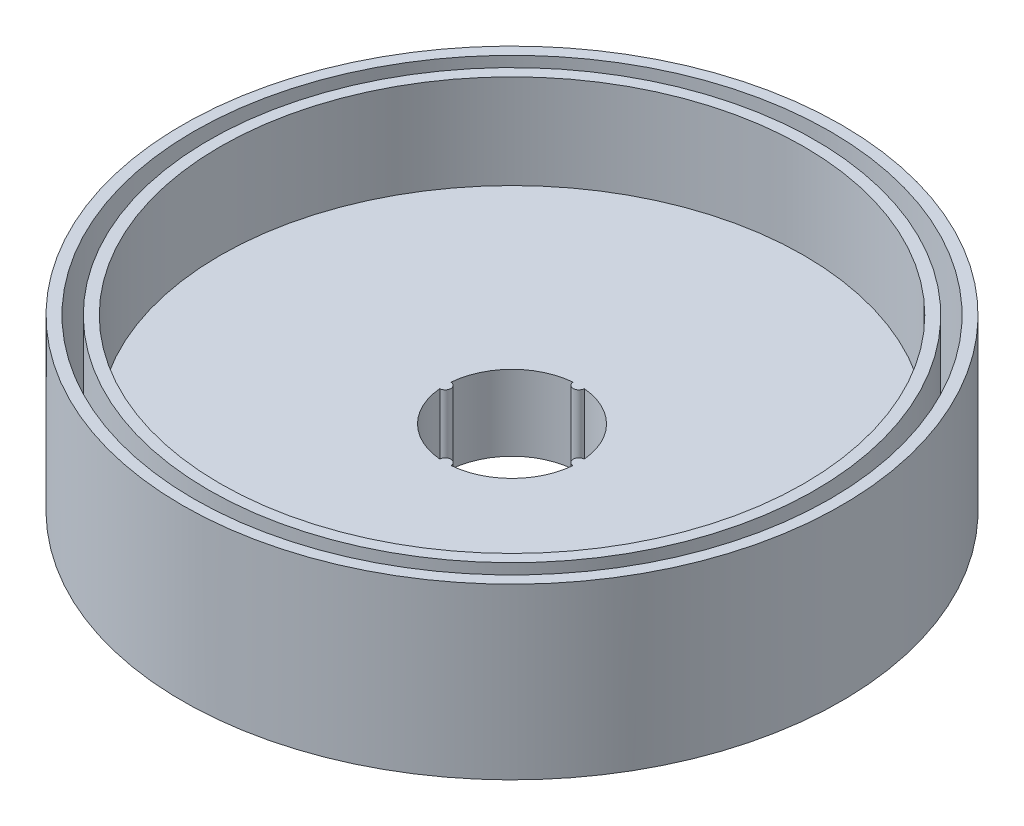
ISO-10303-21;
HEADER;
FILE_DESCRIPTION(('STEP AP214'),'2;1');
FILE_NAME('part.step','',(''),(''),'','','');
FILE_SCHEMA(('AUTOMOTIVE_DESIGN { 1 0 10303 214 1 1 1 1 }'));
ENDSEC;
DATA;
#1=APPLICATION_CONTEXT('core data for automotive mechanical design processes');
#2=APPLICATION_PROTOCOL_DEFINITION('international standard','automotive_design',2000,#1);
#3=PRODUCT_CONTEXT('',#1,'mechanical');
#4=PRODUCT('Part','Part','',(#3));
#5=PRODUCT_RELATED_PRODUCT_CATEGORY('part','',(#4));
#6=PRODUCT_DEFINITION_FORMATION('','',#4);
#7=PRODUCT_DEFINITION_CONTEXT('part definition',#1,'design');
#8=PRODUCT_DEFINITION('design','',#6,#7);
#9=PRODUCT_DEFINITION_SHAPE('','',#8);
#10=(LENGTH_UNIT() NAMED_UNIT(*) SI_UNIT(.MILLI.,.METRE.));
#11=(NAMED_UNIT(*) PLANE_ANGLE_UNIT() SI_UNIT($,.RADIAN.));
#12=(NAMED_UNIT(*) SI_UNIT($,.STERADIAN.) SOLID_ANGLE_UNIT());
#13=UNCERTAINTY_MEASURE_WITH_UNIT(LENGTH_MEASURE(1.E-05),#10,'distance_accuracy_value','');
#14=(GEOMETRIC_REPRESENTATION_CONTEXT(3) GLOBAL_UNCERTAINTY_ASSIGNED_CONTEXT((#13)) GLOBAL_UNIT_ASSIGNED_CONTEXT((#10,
#11,#12)) REPRESENTATION_CONTEXT('',''));
#15=CARTESIAN_POINT('',(0.,0.,0.));
#16=DIRECTION('',(0.,0.,1.));
#17=DIRECTION('',(1.,0.,0.));
#18=AXIS2_PLACEMENT_3D('',#15,#16,#17);
#19=CARTESIAN_POINT('',(0.,5.,0.));
#20=DIRECTION('',(0.,1.,0.));
#21=DIRECTION('',(0.,0.,1.));
#22=AXIS2_PLACEMENT_3D('',#19,#20,#21);
#23=PLANE('',#22);
#24=CARTESIAN_POINT('',(0.,5.,0.));
#25=DIRECTION('',(0.,1.,0.));
#26=DIRECTION('',(0.,0.,1.));
#27=AXIS2_PLACEMENT_3D('',#24,#25,#26);
#28=CIRCLE('',#27,15.5);
#29=CARTESIAN_POINT('',(0.,5.,15.5));
#30=VERTEX_POINT('',#29);
#31=EDGE_CURVE('E41',#30,#30,#28,.T.);
#32=ORIENTED_EDGE('',*,*,#31,.F.);
#33=EDGE_LOOP('',(#32));
#34=FACE_BOUND('',#33,.T.);
#35=CARTESIAN_POINT('',(0.,5.,0.));
#36=DIRECTION('',(0.,1.,0.));
#37=DIRECTION('',(0.,0.,1.));
#38=AXIS2_PLACEMENT_3D('',#35,#36,#37);
#39=CIRCLE('',#38,16.1);
#40=CARTESIAN_POINT('',(0.,5.,16.1));
#41=VERTEX_POINT('',#40);
#42=EDGE_CURVE('E197',#41,#41,#39,.T.);
#43=ORIENTED_EDGE('',*,*,#42,.T.);
#44=EDGE_LOOP('',(#43));
#45=FACE_BOUND('',#44,.T.);
#46=ADVANCED_FACE('F33',(#34,#45),#23,.T.);
#47=CARTESIAN_POINT('',(0.,5.,0.));
#48=DIRECTION('',(0.,1.,0.));
#49=DIRECTION('',(0.,0.,1.));
#50=AXIS2_PLACEMENT_3D('',#47,#48,#49);
#51=CIRCLE('',#50,16.9);
#52=CARTESIAN_POINT('',(0.,5.,16.9));
#53=VERTEX_POINT('',#52);
#54=EDGE_CURVE('E202',#53,#53,#51,.T.);
#55=ORIENTED_EDGE('',*,*,#54,.F.);
#56=EDGE_LOOP('',(#55));
#57=FACE_BOUND('',#56,.T.);
#58=CARTESIAN_POINT('',(0.,5.,0.));
#59=DIRECTION('',(0.,1.,0.));
#60=DIRECTION('',(0.,0.,1.));
#61=AXIS2_PLACEMENT_3D('',#58,#59,#60);
#62=CIRCLE('',#61,17.5);
#63=CARTESIAN_POINT('',(0.,5.,17.5));
#64=VERTEX_POINT('',#63);
#65=EDGE_CURVE('E11',#64,#64,#62,.T.);
#66=ORIENTED_EDGE('',*,*,#65,.T.);
#67=EDGE_LOOP('',(#66));
#68=FACE_BOUND('',#67,.T.);
#69=ADVANCED_FACE('F185',(#57,#68),#23,.T.);
#70=CARTESIAN_POINT('',(0.,5.,0.));
#71=DIRECTION('',(0.,-1.,0.));
#72=DIRECTION('',(0.,0.,-1.));
#73=AXIS2_PLACEMENT_3D('',#70,#71,#72);
#74=CYLINDRICAL_SURFACE('',#73,17.5);
#75=ORIENTED_EDGE('',*,*,#65,.F.);
#76=EDGE_LOOP('',(#75));
#77=FACE_BOUND('',#76,.T.);
#78=CARTESIAN_POINT('',(0.,-4.,0.));
#79=DIRECTION('',(0.,-1.,0.));
#80=DIRECTION('',(0.,0.,-1.));
#81=AXIS2_PLACEMENT_3D('',#78,#79,#80);
#82=CIRCLE('',#81,17.5);
#83=CARTESIAN_POINT('',(0.,-4.,-17.5));
#84=VERTEX_POINT('',#83);
#85=EDGE_CURVE('E114',#84,#84,#82,.T.);
#86=ORIENTED_EDGE('',*,*,#85,.F.);
#87=EDGE_LOOP('',(#86));
#88=FACE_BOUND('',#87,.T.);
#89=ADVANCED_FACE('F35',(#77,#88),#74,.T.);
#90=CARTESIAN_POINT('',(0.,5.,0.));
#91=DIRECTION('',(0.,-1.,0.));
#92=DIRECTION('',(0.,0.,-1.));
#93=AXIS2_PLACEMENT_3D('',#90,#91,#92);
#94=CYLINDRICAL_SURFACE('',#93,15.5);
#95=ORIENTED_EDGE('',*,*,#31,.T.);
#96=EDGE_LOOP('',(#95));
#97=FACE_BOUND('',#96,.T.);
#98=CARTESIAN_POINT('',(0.,0.,0.));
#99=DIRECTION('',(0.,1.,0.));
#100=DIRECTION('',(0.,0.,1.));
#101=AXIS2_PLACEMENT_3D('',#98,#99,#100);
#102=CIRCLE('',#101,15.5);
#103=CARTESIAN_POINT('',(0.,0.,15.5));
#104=VERTEX_POINT('',#103);
#105=EDGE_CURVE('E168',#104,#104,#102,.T.);
#106=ORIENTED_EDGE('',*,*,#105,.F.);
#107=EDGE_LOOP('',(#106));
#108=FACE_BOUND('',#107,.T.);
#109=ADVANCED_FACE('F175',(#97,#108),#94,.F.);
#110=CARTESIAN_POINT('',(0.,0.,0.));
#111=DIRECTION('',(0.,-1.,0.));
#112=DIRECTION('',(0.,0.,-1.));
#113=AXIS2_PLACEMENT_3D('',#110,#111,#112);
#114=PLANE('',#113);
#115=CARTESIAN_POINT('',(0.,0.,0.));
#116=DIRECTION('',(0.,-1.,0.));
#117=DIRECTION('',(0.,0.,-1.));
#118=AXIS2_PLACEMENT_3D('',#115,#116,#117);
#119=CIRCLE('',#118,3.55);
#120=CARTESIAN_POINT('',(0.299732076354392,0.,-3.53732394366197));
#121=VERTEX_POINT('',#120);
#122=CARTESIAN_POINT('',(3.53732394366197,0.,-0.299732076354392));
#123=VERTEX_POINT('',#122);
#124=EDGE_CURVE('E56',#121,#123,#119,.T.);
#125=ORIENTED_EDGE('',*,*,#124,.T.);
#126=CARTESIAN_POINT('',(3.55,0.,0.));
#127=DIRECTION('',(0.,1.,0.));
#128=DIRECTION('',(0.,0.,-1.));
#129=AXIS2_PLACEMENT_3D('',#126,#127,#128);
#130=CIRCLE('',#129,0.3);
#131=CARTESIAN_POINT('',(3.53732394366197,0.,0.299732076354392));
#132=VERTEX_POINT('',#131);
#133=EDGE_CURVE('E113',#123,#132,#130,.T.);
#134=ORIENTED_EDGE('',*,*,#133,.T.);
#135=CARTESIAN_POINT('',(0.,0.,0.));
#136=DIRECTION('',(0.,-1.,0.));
#137=DIRECTION('',(0.,0.,-1.));
#138=AXIS2_PLACEMENT_3D('',#135,#136,#137);
#139=CIRCLE('',#138,3.55);
#140=CARTESIAN_POINT('',(0.299732076354392,0.,3.53732394366197));
#141=VERTEX_POINT('',#140);
#142=EDGE_CURVE('E138',#132,#141,#139,.T.);
#143=ORIENTED_EDGE('',*,*,#142,.T.);
#144=CARTESIAN_POINT('',(0.,0.,3.55));
#145=DIRECTION('',(0.,1.,0.));
#146=DIRECTION('',(0.,0.,-1.));
#147=AXIS2_PLACEMENT_3D('',#144,#145,#146);
#148=CIRCLE('',#147,0.3);
#149=CARTESIAN_POINT('',(-0.299732076354392,0.,3.53732394366197));
#150=VERTEX_POINT('',#149);
#151=EDGE_CURVE('E141',#141,#150,#148,.T.);
#152=ORIENTED_EDGE('',*,*,#151,.T.);
#153=CARTESIAN_POINT('',(0.,0.,0.));
#154=DIRECTION('',(0.,-1.,0.));
#155=DIRECTION('',(0.,0.,-1.));
#156=AXIS2_PLACEMENT_3D('',#153,#154,#155);
#157=CIRCLE('',#156,3.55);
#158=CARTESIAN_POINT('',(-3.53732394366197,0.,0.299732076354392));
#159=VERTEX_POINT('',#158);
#160=EDGE_CURVE('E144',#150,#159,#157,.T.);
#161=ORIENTED_EDGE('',*,*,#160,.T.);
#162=CARTESIAN_POINT('',(-3.55,0.,0.));
#163=DIRECTION('',(0.,1.,0.));
#164=DIRECTION('',(0.,0.,-1.));
#165=AXIS2_PLACEMENT_3D('',#162,#163,#164);
#166=CIRCLE('',#165,0.3);
#167=CARTESIAN_POINT('',(-3.53732394366197,0.,-0.299732076354392));
#168=VERTEX_POINT('',#167);
#169=EDGE_CURVE('E147',#159,#168,#166,.T.);
#170=ORIENTED_EDGE('',*,*,#169,.T.);
#171=CARTESIAN_POINT('',(0.,0.,0.));
#172=DIRECTION('',(0.,-1.,0.));
#173=DIRECTION('',(0.,0.,-1.));
#174=AXIS2_PLACEMENT_3D('',#171,#172,#173);
#175=CIRCLE('',#174,3.55);
#176=CARTESIAN_POINT('',(-0.299732076354392,0.,-3.53732394366197));
#177=VERTEX_POINT('',#176);
#178=EDGE_CURVE('E150',#168,#177,#175,.T.);
#179=ORIENTED_EDGE('',*,*,#178,.T.);
#180=CARTESIAN_POINT('',(0.,0.,-3.55));
#181=DIRECTION('',(0.,1.,0.));
#182=DIRECTION('',(0.,0.,-1.));
#183=AXIS2_PLACEMENT_3D('',#180,#181,#182);
#184=CIRCLE('',#183,0.3);
#185=EDGE_CURVE('E107',#177,#121,#184,.T.);
#186=ORIENTED_EDGE('',*,*,#185,.T.);
#187=EDGE_LOOP('',(#125,#134,#143,#152,#161,#170,#179,#186));
#188=FACE_BOUND('',#187,.T.);
#189=ORIENTED_EDGE('',*,*,#105,.T.);
#190=EDGE_LOOP('',(#189));
#191=FACE_BOUND('',#190,.T.);
#192=ADVANCED_FACE('F173',(#188,#191),#114,.F.);
#193=CARTESIAN_POINT('',(0.,-4.,0.));
#194=DIRECTION('',(0.,-1.,0.));
#195=DIRECTION('',(0.,0.,-1.));
#196=AXIS2_PLACEMENT_3D('',#193,#194,#195);
#197=PLANE('',#196);
#198=ORIENTED_EDGE('',*,*,#85,.T.);
#199=EDGE_LOOP('',(#198));
#200=FACE_BOUND('',#199,.T.);
#201=CARTESIAN_POINT('',(3.55,-4.,0.));
#202=DIRECTION('',(0.,1.,0.));
#203=DIRECTION('',(0.,0.,-1.));
#204=AXIS2_PLACEMENT_3D('',#201,#202,#203);
#205=CIRCLE('',#204,0.3);
#206=CARTESIAN_POINT('',(3.53732394366197,-4.,-0.299732076354392));
#207=VERTEX_POINT('',#206);
#208=CARTESIAN_POINT('',(3.53732394366197,-4.,0.299732076354392));
#209=VERTEX_POINT('',#208);
#210=EDGE_CURVE('E106',#207,#209,#205,.T.);
#211=ORIENTED_EDGE('',*,*,#210,.F.);
#212=CARTESIAN_POINT('',(0.,-4.,0.));
#213=DIRECTION('',(0.,-1.,0.));
#214=DIRECTION('',(0.,0.,-1.));
#215=AXIS2_PLACEMENT_3D('',#212,#213,#214);
#216=CIRCLE('',#215,3.55);
#217=CARTESIAN_POINT('',(0.299732076354392,-4.,-3.53732394366197));
#218=VERTEX_POINT('',#217);
#219=EDGE_CURVE('E98',#218,#207,#216,.T.);
#220=ORIENTED_EDGE('',*,*,#219,.F.);
#221=CARTESIAN_POINT('',(0.,-4.,-3.55));
#222=DIRECTION('',(0.,1.,0.));
#223=DIRECTION('',(0.,0.,-1.));
#224=AXIS2_PLACEMENT_3D('',#221,#222,#223);
#225=CIRCLE('',#224,0.3);
#226=CARTESIAN_POINT('',(-0.299732076354392,-4.,-3.53732394366197));
#227=VERTEX_POINT('',#226);
#228=EDGE_CURVE('E133',#227,#218,#225,.T.);
#229=ORIENTED_EDGE('',*,*,#228,.F.);
#230=CARTESIAN_POINT('',(0.,-4.,0.));
#231=DIRECTION('',(0.,-1.,0.));
#232=DIRECTION('',(0.,0.,-1.));
#233=AXIS2_PLACEMENT_3D('',#230,#231,#232);
#234=CIRCLE('',#233,3.55);
#235=CARTESIAN_POINT('',(-3.53732394366197,-4.,-0.299732076354392));
#236=VERTEX_POINT('',#235);
#237=EDGE_CURVE('E131',#236,#227,#234,.T.);
#238=ORIENTED_EDGE('',*,*,#237,.F.);
#239=CARTESIAN_POINT('',(-3.55,-4.,0.));
#240=DIRECTION('',(0.,1.,0.));
#241=DIRECTION('',(0.,0.,-1.));
#242=AXIS2_PLACEMENT_3D('',#239,#240,#241);
#243=CIRCLE('',#242,0.3);
#244=CARTESIAN_POINT('',(-3.53732394366197,-4.,0.299732076354392));
#245=VERTEX_POINT('',#244);
#246=EDGE_CURVE('E129',#245,#236,#243,.T.);
#247=ORIENTED_EDGE('',*,*,#246,.F.);
#248=CARTESIAN_POINT('',(0.,-4.,0.));
#249=DIRECTION('',(0.,-1.,0.));
#250=DIRECTION('',(0.,0.,-1.));
#251=AXIS2_PLACEMENT_3D('',#248,#249,#250);
#252=CIRCLE('',#251,3.55);
#253=CARTESIAN_POINT('',(-0.299732076354392,-4.,3.53732394366197));
#254=VERTEX_POINT('',#253);
#255=EDGE_CURVE('E127',#254,#245,#252,.T.);
#256=ORIENTED_EDGE('',*,*,#255,.F.);
#257=CARTESIAN_POINT('',(0.,-4.,3.55));
#258=DIRECTION('',(0.,1.,0.));
#259=DIRECTION('',(0.,0.,-1.));
#260=AXIS2_PLACEMENT_3D('',#257,#258,#259);
#261=CIRCLE('',#260,0.3);
#262=CARTESIAN_POINT('',(0.299732076354392,-4.,3.53732394366197));
#263=VERTEX_POINT('',#262);
#264=EDGE_CURVE('E122',#263,#254,#261,.T.);
#265=ORIENTED_EDGE('',*,*,#264,.F.);
#266=CARTESIAN_POINT('',(0.,-4.,0.));
#267=DIRECTION('',(0.,-1.,0.));
#268=DIRECTION('',(0.,0.,-1.));
#269=AXIS2_PLACEMENT_3D('',#266,#267,#268);
#270=CIRCLE('',#269,3.55);
#271=EDGE_CURVE('E120',#209,#263,#270,.T.);
#272=ORIENTED_EDGE('',*,*,#271,.F.);
#273=EDGE_LOOP('',(#211,#220,#229,#238,#247,#256,#265,#272));
#274=FACE_BOUND('',#273,.T.);
#275=ADVANCED_FACE('F118',(#200,#274),#197,.T.);
#276=CARTESIAN_POINT('',(0.,-4.,0.));
#277=DIRECTION('',(0.,1.,0.));
#278=DIRECTION('',(0.,0.,1.));
#279=AXIS2_PLACEMENT_3D('',#276,#277,#278);
#280=CYLINDRICAL_SURFACE('',#279,3.55);
#281=ORIENTED_EDGE('',*,*,#124,.F.);
#282=DIRECTION('',(0.,1.,0.));
#283=VECTOR('',#282,1.);
#284=CARTESIAN_POINT('',(0.299732076354392,-4.,-3.53732394366197));
#285=LINE('',#284,#283);
#286=EDGE_CURVE('E102',#218,#121,#285,.T.);
#287=ORIENTED_EDGE('',*,*,#286,.F.);
#288=ORIENTED_EDGE('',*,*,#219,.T.);
#289=DIRECTION('',(0.,1.,0.));
#290=VECTOR('',#289,1.);
#291=CARTESIAN_POINT('',(3.53732394366197,-4.,-0.299732076354392));
#292=LINE('',#291,#290);
#293=EDGE_CURVE('E101',#207,#123,#292,.T.);
#294=ORIENTED_EDGE('',*,*,#293,.T.);
#295=EDGE_LOOP('',(#281,#287,#288,#294));
#296=FACE_BOUND('',#295,.T.);
#297=ADVANCED_FACE('F100',(#296),#280,.F.);
#298=CARTESIAN_POINT('',(3.55,-4.,0.));
#299=DIRECTION('',(0.,1.,0.));
#300=DIRECTION('',(0.,0.,1.));
#301=AXIS2_PLACEMENT_3D('',#298,#299,#300);
#302=CYLINDRICAL_SURFACE('',#301,0.3);
#303=ORIENTED_EDGE('',*,*,#133,.F.);
#304=ORIENTED_EDGE('',*,*,#293,.F.);
#305=ORIENTED_EDGE('',*,*,#210,.T.);
#306=DIRECTION('',(0.,1.,0.));
#307=VECTOR('',#306,1.);
#308=CARTESIAN_POINT('',(3.53732394366197,-4.,0.299732076354392));
#309=LINE('',#308,#307);
#310=EDGE_CURVE('E115',#209,#132,#309,.T.);
#311=ORIENTED_EDGE('',*,*,#310,.T.);
#312=EDGE_LOOP('',(#303,#304,#305,#311));
#313=FACE_BOUND('',#312,.T.);
#314=ADVANCED_FACE('F110',(#313),#302,.T.);
#315=CARTESIAN_POINT('',(0.,-4.,0.));
#316=DIRECTION('',(0.,1.,0.));
#317=DIRECTION('',(0.,0.,1.));
#318=AXIS2_PLACEMENT_3D('',#315,#316,#317);
#319=CYLINDRICAL_SURFACE('',#318,3.55);
#320=ORIENTED_EDGE('',*,*,#142,.F.);
#321=ORIENTED_EDGE('',*,*,#310,.F.);
#322=ORIENTED_EDGE('',*,*,#271,.T.);
#323=DIRECTION('',(0.,1.,0.));
#324=VECTOR('',#323,1.);
#325=CARTESIAN_POINT('',(0.299732076354392,-4.,3.53732394366197));
#326=LINE('',#325,#324);
#327=EDGE_CURVE('E163',#263,#141,#326,.T.);
#328=ORIENTED_EDGE('',*,*,#327,.T.);
#329=EDGE_LOOP('',(#320,#321,#322,#328));
#330=FACE_BOUND('',#329,.T.);
#331=ADVANCED_FACE('F224',(#330),#319,.F.);
#332=CARTESIAN_POINT('',(0.,-4.,3.55));
#333=DIRECTION('',(0.,1.,0.));
#334=DIRECTION('',(0.,0.,1.));
#335=AXIS2_PLACEMENT_3D('',#332,#333,#334);
#336=CYLINDRICAL_SURFACE('',#335,0.3);
#337=ORIENTED_EDGE('',*,*,#151,.F.);
#338=ORIENTED_EDGE('',*,*,#327,.F.);
#339=ORIENTED_EDGE('',*,*,#264,.T.);
#340=DIRECTION('',(0.,1.,0.));
#341=VECTOR('',#340,1.);
#342=CARTESIAN_POINT('',(-0.299732076354392,-4.,3.53732394366197));
#343=LINE('',#342,#341);
#344=EDGE_CURVE('E161',#254,#150,#343,.T.);
#345=ORIENTED_EDGE('',*,*,#344,.T.);
#346=EDGE_LOOP('',(#337,#338,#339,#345));
#347=FACE_BOUND('',#346,.T.);
#348=ADVANCED_FACE('F227',(#347),#336,.T.);
#349=CARTESIAN_POINT('',(0.,-4.,0.));
#350=DIRECTION('',(0.,1.,0.));
#351=DIRECTION('',(0.,0.,1.));
#352=AXIS2_PLACEMENT_3D('',#349,#350,#351);
#353=CYLINDRICAL_SURFACE('',#352,3.55);
#354=ORIENTED_EDGE('',*,*,#160,.F.);
#355=ORIENTED_EDGE('',*,*,#344,.F.);
#356=ORIENTED_EDGE('',*,*,#255,.T.);
#357=DIRECTION('',(0.,1.,0.));
#358=VECTOR('',#357,1.);
#359=CARTESIAN_POINT('',(-3.53732394366197,-4.,0.299732076354392));
#360=LINE('',#359,#358);
#361=EDGE_CURVE('E159',#245,#159,#360,.T.);
#362=ORIENTED_EDGE('',*,*,#361,.T.);
#363=EDGE_LOOP('',(#354,#355,#356,#362));
#364=FACE_BOUND('',#363,.T.);
#365=ADVANCED_FACE('F231',(#364),#353,.F.);
#366=CARTESIAN_POINT('',(-3.55,-4.,0.));
#367=DIRECTION('',(0.,1.,0.));
#368=DIRECTION('',(0.,0.,1.));
#369=AXIS2_PLACEMENT_3D('',#366,#367,#368);
#370=CYLINDRICAL_SURFACE('',#369,0.3);
#371=ORIENTED_EDGE('',*,*,#169,.F.);
#372=ORIENTED_EDGE('',*,*,#361,.F.);
#373=ORIENTED_EDGE('',*,*,#246,.T.);
#374=DIRECTION('',(0.,1.,0.));
#375=VECTOR('',#374,1.);
#376=CARTESIAN_POINT('',(-3.53732394366197,-4.,-0.299732076354392));
#377=LINE('',#376,#375);
#378=EDGE_CURVE('E157',#236,#168,#377,.T.);
#379=ORIENTED_EDGE('',*,*,#378,.T.);
#380=EDGE_LOOP('',(#371,#372,#373,#379));
#381=FACE_BOUND('',#380,.T.);
#382=ADVANCED_FACE('F235',(#381),#370,.T.);
#383=CARTESIAN_POINT('',(0.,-4.,0.));
#384=DIRECTION('',(0.,1.,0.));
#385=DIRECTION('',(0.,0.,1.));
#386=AXIS2_PLACEMENT_3D('',#383,#384,#385);
#387=CYLINDRICAL_SURFACE('',#386,3.55);
#388=ORIENTED_EDGE('',*,*,#178,.F.);
#389=ORIENTED_EDGE('',*,*,#378,.F.);
#390=ORIENTED_EDGE('',*,*,#237,.T.);
#391=DIRECTION('',(0.,1.,0.));
#392=VECTOR('',#391,1.);
#393=CARTESIAN_POINT('',(-0.299732076354392,-4.,-3.53732394366197));
#394=LINE('',#393,#392);
#395=EDGE_CURVE('E48',#227,#177,#394,.T.);
#396=ORIENTED_EDGE('',*,*,#395,.T.);
#397=EDGE_LOOP('',(#388,#389,#390,#396));
#398=FACE_BOUND('',#397,.T.);
#399=ADVANCED_FACE('F239',(#398),#387,.F.);
#400=CARTESIAN_POINT('',(0.,-4.,-3.55));
#401=DIRECTION('',(0.,1.,0.));
#402=DIRECTION('',(0.,0.,1.));
#403=AXIS2_PLACEMENT_3D('',#400,#401,#402);
#404=CYLINDRICAL_SURFACE('',#403,0.3);
#405=ORIENTED_EDGE('',*,*,#185,.F.);
#406=ORIENTED_EDGE('',*,*,#395,.F.);
#407=ORIENTED_EDGE('',*,*,#228,.T.);
#408=ORIENTED_EDGE('',*,*,#286,.T.);
#409=EDGE_LOOP('',(#405,#406,#407,#408));
#410=FACE_BOUND('',#409,.T.);
#411=ADVANCED_FACE('F243',(#410),#404,.T.);
#412=CARTESIAN_POINT('',(0.,-3.,0.));
#413=DIRECTION('',(0.,1.,0.));
#414=DIRECTION('',(0.,0.,1.));
#415=AXIS2_PLACEMENT_3D('',#412,#413,#414);
#416=CYLINDRICAL_SURFACE('',#415,16.9);
#417=CARTESIAN_POINT('',(0.,-3.,0.));
#418=DIRECTION('',(0.,1.,0.));
#419=DIRECTION('',(0.,0.,1.));
#420=AXIS2_PLACEMENT_3D('',#417,#418,#419);
#421=CIRCLE('',#420,16.9);
#422=CARTESIAN_POINT('',(0.,-3.,16.9));
#423=VERTEX_POINT('',#422);
#424=EDGE_CURVE('E136',#423,#423,#421,.T.);
#425=ORIENTED_EDGE('',*,*,#424,.F.);
#426=EDGE_LOOP('',(#425));
#427=FACE_BOUND('',#426,.T.);
#428=ORIENTED_EDGE('',*,*,#54,.T.);
#429=EDGE_LOOP('',(#428));
#430=FACE_BOUND('',#429,.T.);
#431=ADVANCED_FACE('F209',(#427,#430),#416,.F.);
#432=CARTESIAN_POINT('',(0.,-3.,0.));
#433=DIRECTION('',(0.,1.,0.));
#434=DIRECTION('',(0.,0.,1.));
#435=AXIS2_PLACEMENT_3D('',#432,#433,#434);
#436=PLANE('',#435);
#437=CARTESIAN_POINT('',(0.,-3.,0.));
#438=DIRECTION('',(0.,1.,0.));
#439=DIRECTION('',(0.,0.,1.));
#440=AXIS2_PLACEMENT_3D('',#437,#438,#439);
#441=CIRCLE('',#440,16.1);
#442=CARTESIAN_POINT('',(0.,-3.,16.1));
#443=VERTEX_POINT('',#442);
#444=EDGE_CURVE('E199',#443,#443,#441,.T.);
#445=ORIENTED_EDGE('',*,*,#444,.F.);
#446=EDGE_LOOP('',(#445));
#447=FACE_BOUND('',#446,.T.);
#448=ORIENTED_EDGE('',*,*,#424,.T.);
#449=EDGE_LOOP('',(#448));
#450=FACE_BOUND('',#449,.T.);
#451=ADVANCED_FACE('F249',(#447,#450),#436,.T.);
#452=CARTESIAN_POINT('',(0.,-3.,0.));
#453=DIRECTION('',(0.,1.,0.));
#454=DIRECTION('',(0.,0.,1.));
#455=AXIS2_PLACEMENT_3D('',#452,#453,#454);
#456=CYLINDRICAL_SURFACE('',#455,16.1);
#457=ORIENTED_EDGE('',*,*,#444,.T.);
#458=EDGE_LOOP('',(#457));
#459=FACE_BOUND('',#458,.T.);
#460=ORIENTED_EDGE('',*,*,#42,.F.);
#461=EDGE_LOOP('',(#460));
#462=FACE_BOUND('',#461,.T.);
#463=ADVANCED_FACE('F253',(#459,#462),#456,.T.);
#464=CLOSED_SHELL('',(#46,#69,#89,#109,#192,#275,#297,#314,#331,#348,#365,#382,#399,#411,#431,
#451,#463));
#465=MANIFOLD_SOLID_BREP('B2',#464);
#466=ADVANCED_BREP_SHAPE_REPRESENTATION('',(#18,#465),#14);
#467=SHAPE_DEFINITION_REPRESENTATION(#9,#466);
ENDSEC;
END-ISO-10303-21;
